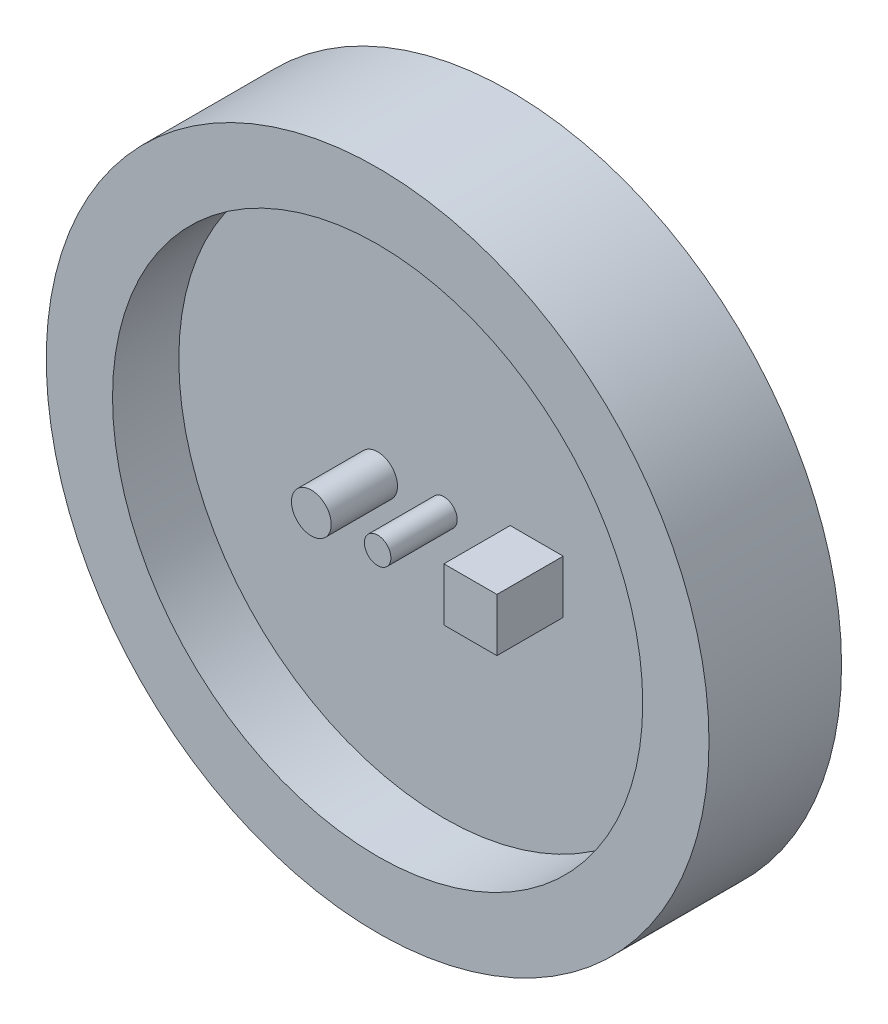
ISO-10303-21;
HEADER;
FILE_DESCRIPTION(('STEP AP214'),'2;1');
FILE_NAME('part.step','',(''),(''),'','','');
FILE_SCHEMA(('AUTOMOTIVE_DESIGN { 1 0 10303 214 1 1 1 1 }'));
ENDSEC;
DATA;
#1=APPLICATION_CONTEXT('core data for automotive mechanical design processes');
#2=APPLICATION_PROTOCOL_DEFINITION('international standard','automotive_design',2000,#1);
#3=PRODUCT_CONTEXT('',#1,'mechanical');
#4=PRODUCT('Part','Part','',(#3));
#5=PRODUCT_RELATED_PRODUCT_CATEGORY('part','',(#4));
#6=PRODUCT_DEFINITION_FORMATION('','',#4);
#7=PRODUCT_DEFINITION_CONTEXT('part definition',#1,'design');
#8=PRODUCT_DEFINITION('design','',#6,#7);
#9=PRODUCT_DEFINITION_SHAPE('','',#8);
#10=(LENGTH_UNIT() NAMED_UNIT(*) SI_UNIT(.MILLI.,.METRE.));
#11=(NAMED_UNIT(*) PLANE_ANGLE_UNIT() SI_UNIT($,.RADIAN.));
#12=(NAMED_UNIT(*) SI_UNIT($,.STERADIAN.) SOLID_ANGLE_UNIT());
#13=UNCERTAINTY_MEASURE_WITH_UNIT(LENGTH_MEASURE(1.E-05),#10,'distance_accuracy_value','');
#14=(GEOMETRIC_REPRESENTATION_CONTEXT(3) GLOBAL_UNCERTAINTY_ASSIGNED_CONTEXT((#13)) GLOBAL_UNIT_ASSIGNED_CONTEXT((#10,
#11,#12)) REPRESENTATION_CONTEXT('',''));
#15=CARTESIAN_POINT('',(0.,0.,0.));
#16=DIRECTION('',(0.,0.,1.));
#17=DIRECTION('',(1.,0.,0.));
#18=AXIS2_PLACEMENT_3D('',#15,#16,#17);
#19=CARTESIAN_POINT('',(0.,0.,5.));
#20=DIRECTION('',(0.,0.,1.));
#21=DIRECTION('',(1.,0.,0.));
#22=AXIS2_PLACEMENT_3D('',#19,#20,#21);
#23=PLANE('',#22);
#24=CARTESIAN_POINT('',(0.,0.,5.));
#25=DIRECTION('',(0.,0.,1.));
#26=DIRECTION('',(1.,0.,0.));
#27=AXIS2_PLACEMENT_3D('',#24,#25,#26);
#28=CIRCLE('',#27,1.);
#29=CARTESIAN_POINT('',(1.,0.,5.));
#30=VERTEX_POINT('',#29);
#31=EDGE_CURVE('E186',#30,#30,#28,.T.);
#32=ORIENTED_EDGE('',*,*,#31,.F.);
#33=EDGE_LOOP('',(#32));
#34=FACE_BOUND('',#33,.T.);
#35=CARTESIAN_POINT('',(-5.,-0.0610876748622365,5.));
#36=DIRECTION('',(0.,0.,1.));
#37=DIRECTION('',(1.,0.,0.));
#38=AXIS2_PLACEMENT_3D('',#35,#36,#37);
#39=CIRCLE('',#38,1.5);
#40=CARTESIAN_POINT('',(-3.5,-0.0610876748622365,5.));
#41=VERTEX_POINT('',#40);
#42=EDGE_CURVE('E116',#41,#41,#39,.T.);
#43=ORIENTED_EDGE('',*,*,#42,.F.);
#44=EDGE_LOOP('',(#43));
#45=FACE_BOUND('',#44,.T.);
#46=CARTESIAN_POINT('',(0.,0.,5.));
#47=DIRECTION('',(0.,0.,1.));
#48=DIRECTION('',(1.,0.,0.));
#49=AXIS2_PLACEMENT_3D('',#46,#47,#48);
#50=CIRCLE('',#49,20.);
#51=CARTESIAN_POINT('',(20.,0.,5.));
#52=VERTEX_POINT('',#51);
#53=EDGE_CURVE('E120',#52,#52,#50,.T.);
#54=ORIENTED_EDGE('',*,*,#53,.T.);
#55=EDGE_LOOP('',(#54));
#56=FACE_BOUND('',#55,.T.);
#57=DIRECTION('',(1.,0.,0.));
#58=VECTOR('',#57,1.);
#59=CARTESIAN_POINT('',(5.,-2.38119326458463,5.));
#60=LINE('',#59,#58);
#61=CARTESIAN_POINT('',(5.,-2.38119326458463,5.));
#62=VERTEX_POINT('',#61);
#63=CARTESIAN_POINT('',(9.,-2.38119326458463,5.));
#64=VERTEX_POINT('',#63);
#65=EDGE_CURVE('E94',#62,#64,#60,.T.);
#66=ORIENTED_EDGE('',*,*,#65,.F.);
#67=DIRECTION('',(0.,-1.,0.));
#68=VECTOR('',#67,1.);
#69=CARTESIAN_POINT('',(5.,-2.38119326458463,5.));
#70=LINE('',#69,#68);
#71=CARTESIAN_POINT('',(5.,1.61880673541537,5.));
#72=VERTEX_POINT('',#71);
#73=EDGE_CURVE('E105',#72,#62,#70,.T.);
#74=ORIENTED_EDGE('',*,*,#73,.F.);
#75=DIRECTION('',(-1.,0.,0.));
#76=VECTOR('',#75,1.);
#77=CARTESIAN_POINT('',(5.,1.61880673541537,5.));
#78=LINE('',#77,#76);
#79=CARTESIAN_POINT('',(9.,1.61880673541537,5.));
#80=VERTEX_POINT('',#79);
#81=EDGE_CURVE('E75',#80,#72,#78,.T.);
#82=ORIENTED_EDGE('',*,*,#81,.F.);
#83=DIRECTION('',(0.,1.,0.));
#84=VECTOR('',#83,1.);
#85=CARTESIAN_POINT('',(9.,-2.38119326458463,5.));
#86=LINE('',#85,#84);
#87=EDGE_CURVE('E110',#64,#80,#86,.T.);
#88=ORIENTED_EDGE('',*,*,#87,.F.);
#89=EDGE_LOOP('',(#66,#74,#82,#88));
#90=FACE_BOUND('',#89,.T.);
#91=ADVANCED_FACE('F38',(#34,#45,#56,#90),#23,.T.);
#92=CARTESIAN_POINT('',(0.,0.,10.));
#93=DIRECTION('',(0.,0.,-1.));
#94=DIRECTION('',(-1.,0.,0.));
#95=AXIS2_PLACEMENT_3D('',#92,#93,#94);
#96=CYLINDRICAL_SURFACE('',#95,25.);
#97=CARTESIAN_POINT('',(0.,0.,10.));
#98=DIRECTION('',(0.,0.,1.));
#99=DIRECTION('',(1.,0.,0.));
#100=AXIS2_PLACEMENT_3D('',#97,#98,#99);
#101=CIRCLE('',#100,25.);
#102=CARTESIAN_POINT('',(25.,0.,10.));
#103=VERTEX_POINT('',#102);
#104=EDGE_CURVE('E11',#103,#103,#101,.T.);
#105=ORIENTED_EDGE('',*,*,#104,.F.);
#106=EDGE_LOOP('',(#105));
#107=FACE_BOUND('',#106,.T.);
#108=CARTESIAN_POINT('',(0.,0.,0.));
#109=DIRECTION('',(0.,0.,1.));
#110=DIRECTION('',(1.,0.,0.));
#111=AXIS2_PLACEMENT_3D('',#108,#109,#110);
#112=CIRCLE('',#111,25.);
#113=CARTESIAN_POINT('',(25.,0.,0.));
#114=VERTEX_POINT('',#113);
#115=EDGE_CURVE('E42',#114,#114,#112,.T.);
#116=ORIENTED_EDGE('',*,*,#115,.T.);
#117=EDGE_LOOP('',(#116));
#118=FACE_BOUND('',#117,.T.);
#119=ADVANCED_FACE('F40',(#107,#118),#96,.T.);
#120=CARTESIAN_POINT('',(0.,0.,10.));
#121=DIRECTION('',(0.,0.,1.));
#122=DIRECTION('',(1.,0.,0.));
#123=AXIS2_PLACEMENT_3D('',#120,#121,#122);
#124=PLANE('',#123);
#125=CARTESIAN_POINT('',(0.,0.,10.));
#126=DIRECTION('',(0.,0.,1.));
#127=DIRECTION('',(1.,0.,0.));
#128=AXIS2_PLACEMENT_3D('',#125,#126,#127);
#129=CIRCLE('',#128,20.);
#130=CARTESIAN_POINT('',(20.,0.,10.));
#131=VERTEX_POINT('',#130);
#132=EDGE_CURVE('E125',#131,#131,#129,.T.);
#133=ORIENTED_EDGE('',*,*,#132,.F.);
#134=EDGE_LOOP('',(#133));
#135=FACE_BOUND('',#134,.T.);
#136=ORIENTED_EDGE('',*,*,#104,.T.);
#137=EDGE_LOOP('',(#136));
#138=FACE_BOUND('',#137,.T.);
#139=ADVANCED_FACE('F136',(#135,#138),#124,.T.);
#140=CARTESIAN_POINT('',(0.,0.,0.));
#141=DIRECTION('',(0.,0.,1.));
#142=DIRECTION('',(1.,0.,0.));
#143=AXIS2_PLACEMENT_3D('',#140,#141,#142);
#144=PLANE('',#143);
#145=ORIENTED_EDGE('',*,*,#115,.F.);
#146=EDGE_LOOP('',(#145));
#147=FACE_BOUND('',#146,.T.);
#148=ADVANCED_FACE('F133',(#147),#144,.F.);
#149=CARTESIAN_POINT('',(0.,0.,10.));
#150=DIRECTION('',(0.,0.,-1.));
#151=DIRECTION('',(-1.,0.,0.));
#152=AXIS2_PLACEMENT_3D('',#149,#150,#151);
#153=CYLINDRICAL_SURFACE('',#152,20.);
#154=ORIENTED_EDGE('',*,*,#132,.T.);
#155=EDGE_LOOP('',(#154));
#156=FACE_BOUND('',#155,.T.);
#157=ORIENTED_EDGE('',*,*,#53,.F.);
#158=EDGE_LOOP('',(#157));
#159=FACE_BOUND('',#158,.T.);
#160=ADVANCED_FACE('F135',(#156,#159),#153,.F.);
#161=CARTESIAN_POINT('',(-5.,-0.0610876748622365,10.));
#162=DIRECTION('',(0.,0.,-1.));
#163=DIRECTION('',(-1.,0.,0.));
#164=AXIS2_PLACEMENT_3D('',#161,#162,#163);
#165=CYLINDRICAL_SURFACE('',#164,1.5);
#166=CARTESIAN_POINT('',(-5.,-0.0610876748622365,10.));
#167=DIRECTION('',(0.,0.,1.));
#168=DIRECTION('',(1.,0.,0.));
#169=AXIS2_PLACEMENT_3D('',#166,#167,#168);
#170=CIRCLE('',#169,1.5);
#171=CARTESIAN_POINT('',(-3.5,-0.0610876748622365,10.));
#172=VERTEX_POINT('',#171);
#173=EDGE_CURVE('E117',#172,#172,#170,.T.);
#174=ORIENTED_EDGE('',*,*,#173,.F.);
#175=EDGE_LOOP('',(#174));
#176=FACE_BOUND('',#175,.T.);
#177=ORIENTED_EDGE('',*,*,#42,.T.);
#178=EDGE_LOOP('',(#177));
#179=FACE_BOUND('',#178,.T.);
#180=ADVANCED_FACE('F141',(#176,#179),#165,.T.);
#181=CARTESIAN_POINT('',(-5.,-0.0610876748622365,10.));
#182=DIRECTION('',(0.,0.,1.));
#183=DIRECTION('',(1.,0.,0.));
#184=AXIS2_PLACEMENT_3D('',#181,#182,#183);
#185=PLANE('',#184);
#186=ORIENTED_EDGE('',*,*,#173,.T.);
#187=EDGE_LOOP('',(#186));
#188=FACE_BOUND('',#187,.T.);
#189=ADVANCED_FACE('F157',(#188),#185,.T.);
#190=CARTESIAN_POINT('',(5.,-2.38119326458463,10.));
#191=DIRECTION('',(1.,0.,0.));
#192=DIRECTION('',(0.,0.,-1.));
#193=AXIS2_PLACEMENT_3D('',#190,#191,#192);
#194=PLANE('',#193);
#195=ORIENTED_EDGE('',*,*,#73,.T.);
#196=DIRECTION('',(0.,0.,-1.));
#197=VECTOR('',#196,1.);
#198=CARTESIAN_POINT('',(5.,-2.38119326458463,10.));
#199=LINE('',#198,#197);
#200=CARTESIAN_POINT('',(5.,-2.38119326458463,10.));
#201=VERTEX_POINT('',#200);
#202=EDGE_CURVE('E97',#201,#62,#199,.T.);
#203=ORIENTED_EDGE('',*,*,#202,.F.);
#204=DIRECTION('',(0.,-1.,0.));
#205=VECTOR('',#204,1.);
#206=CARTESIAN_POINT('',(5.,-2.38119326458463,10.));
#207=LINE('',#206,#205);
#208=CARTESIAN_POINT('',(5.,1.61880673541537,10.));
#209=VERTEX_POINT('',#208);
#210=EDGE_CURVE('E87',#209,#201,#207,.T.);
#211=ORIENTED_EDGE('',*,*,#210,.F.);
#212=DIRECTION('',(0.,0.,-1.));
#213=VECTOR('',#212,1.);
#214=CARTESIAN_POINT('',(5.,1.61880673541537,10.));
#215=LINE('',#214,#213);
#216=EDGE_CURVE('E101',#209,#72,#215,.T.);
#217=ORIENTED_EDGE('',*,*,#216,.T.);
#218=EDGE_LOOP('',(#195,#203,#211,#217));
#219=FACE_BOUND('',#218,.T.);
#220=ADVANCED_FACE('F161',(#219),#194,.F.);
#221=CARTESIAN_POINT('',(5.,-2.38119326458463,10.));
#222=DIRECTION('',(0.,1.,0.));
#223=DIRECTION('',(0.,0.,1.));
#224=AXIS2_PLACEMENT_3D('',#221,#222,#223);
#225=PLANE('',#224);
#226=ORIENTED_EDGE('',*,*,#65,.T.);
#227=DIRECTION('',(0.,0.,-1.));
#228=VECTOR('',#227,1.);
#229=CARTESIAN_POINT('',(9.,-2.38119326458463,10.));
#230=LINE('',#229,#228);
#231=CARTESIAN_POINT('',(9.,-2.38119326458463,10.));
#232=VERTEX_POINT('',#231);
#233=EDGE_CURVE('E91',#232,#64,#230,.T.);
#234=ORIENTED_EDGE('',*,*,#233,.F.);
#235=DIRECTION('',(1.,0.,0.));
#236=VECTOR('',#235,1.);
#237=CARTESIAN_POINT('',(5.,-2.38119326458463,10.));
#238=LINE('',#237,#236);
#239=EDGE_CURVE('E82',#201,#232,#238,.T.);
#240=ORIENTED_EDGE('',*,*,#239,.F.);
#241=ORIENTED_EDGE('',*,*,#202,.T.);
#242=EDGE_LOOP('',(#226,#234,#240,#241));
#243=FACE_BOUND('',#242,.T.);
#244=ADVANCED_FACE('F92',(#243),#225,.F.);
#245=CARTESIAN_POINT('',(9.,-2.38119326458463,10.));
#246=DIRECTION('',(-1.,0.,0.));
#247=DIRECTION('',(0.,0.,1.));
#248=AXIS2_PLACEMENT_3D('',#245,#246,#247);
#249=PLANE('',#248);
#250=ORIENTED_EDGE('',*,*,#87,.T.);
#251=DIRECTION('',(0.,0.,-1.));
#252=VECTOR('',#251,1.);
#253=CARTESIAN_POINT('',(9.,1.61880673541537,10.));
#254=LINE('',#253,#252);
#255=CARTESIAN_POINT('',(9.,1.61880673541537,10.));
#256=VERTEX_POINT('',#255);
#257=EDGE_CURVE('E53',#256,#80,#254,.T.);
#258=ORIENTED_EDGE('',*,*,#257,.F.);
#259=DIRECTION('',(0.,1.,0.));
#260=VECTOR('',#259,1.);
#261=CARTESIAN_POINT('',(9.,-2.38119326458463,10.));
#262=LINE('',#261,#260);
#263=EDGE_CURVE('E85',#232,#256,#262,.T.);
#264=ORIENTED_EDGE('',*,*,#263,.F.);
#265=ORIENTED_EDGE('',*,*,#233,.T.);
#266=EDGE_LOOP('',(#250,#258,#264,#265));
#267=FACE_BOUND('',#266,.T.);
#268=ADVANCED_FACE('F99',(#267),#249,.F.);
#269=CARTESIAN_POINT('',(5.,1.61880673541537,10.));
#270=DIRECTION('',(0.,-1.,0.));
#271=DIRECTION('',(0.,0.,-1.));
#272=AXIS2_PLACEMENT_3D('',#269,#270,#271);
#273=PLANE('',#272);
#274=ORIENTED_EDGE('',*,*,#81,.T.);
#275=ORIENTED_EDGE('',*,*,#216,.F.);
#276=DIRECTION('',(-1.,0.,0.));
#277=VECTOR('',#276,1.);
#278=CARTESIAN_POINT('',(5.,1.61880673541537,10.));
#279=LINE('',#278,#277);
#280=EDGE_CURVE('E61',#256,#209,#279,.T.);
#281=ORIENTED_EDGE('',*,*,#280,.F.);
#282=ORIENTED_EDGE('',*,*,#257,.T.);
#283=EDGE_LOOP('',(#274,#275,#281,#282));
#284=FACE_BOUND('',#283,.T.);
#285=ADVANCED_FACE('F170',(#284),#273,.F.);
#286=CARTESIAN_POINT('',(0.,0.,10.));
#287=DIRECTION('',(0.,0.,-1.));
#288=DIRECTION('',(-1.,0.,0.));
#289=AXIS2_PLACEMENT_3D('',#286,#287,#288);
#290=PLANE('',#289);
#291=ORIENTED_EDGE('',*,*,#210,.T.);
#292=ORIENTED_EDGE('',*,*,#239,.T.);
#293=ORIENTED_EDGE('',*,*,#263,.T.);
#294=ORIENTED_EDGE('',*,*,#280,.T.);
#295=EDGE_LOOP('',(#291,#292,#293,#294));
#296=FACE_BOUND('',#295,.T.);
#297=ADVANCED_FACE('F83',(#296),#290,.F.);
#298=CARTESIAN_POINT('',(0.,0.,10.));
#299=DIRECTION('',(0.,0.,-1.));
#300=DIRECTION('',(-1.,0.,0.));
#301=AXIS2_PLACEMENT_3D('',#298,#299,#300);
#302=CYLINDRICAL_SURFACE('',#301,1.);
#303=CARTESIAN_POINT('',(0.,0.,10.));
#304=DIRECTION('',(0.,0.,1.));
#305=DIRECTION('',(1.,0.,0.));
#306=AXIS2_PLACEMENT_3D('',#303,#304,#305);
#307=CIRCLE('',#306,1.);
#308=CARTESIAN_POINT('',(1.,0.,10.));
#309=VERTEX_POINT('',#308);
#310=EDGE_CURVE('E108',#309,#309,#307,.T.);
#311=ORIENTED_EDGE('',*,*,#310,.F.);
#312=EDGE_LOOP('',(#311));
#313=FACE_BOUND('',#312,.T.);
#314=ORIENTED_EDGE('',*,*,#31,.T.);
#315=EDGE_LOOP('',(#314));
#316=FACE_BOUND('',#315,.T.);
#317=ADVANCED_FACE('F175',(#313,#316),#302,.T.);
#318=CARTESIAN_POINT('',(0.,0.,10.));
#319=DIRECTION('',(0.,0.,1.));
#320=DIRECTION('',(1.,0.,0.));
#321=AXIS2_PLACEMENT_3D('',#318,#319,#320);
#322=PLANE('',#321);
#323=ORIENTED_EDGE('',*,*,#310,.T.);
#324=EDGE_LOOP('',(#323));
#325=FACE_BOUND('',#324,.T.);
#326=ADVANCED_FACE('F178',(#325),#322,.T.);
#327=CLOSED_SHELL('',(#91,#119,#139,#148,#160,#180,#189,#220,#244,#268,#285,#297,#317,#326));
#328=MANIFOLD_SOLID_BREP('B2',#327);
#329=ADVANCED_BREP_SHAPE_REPRESENTATION('',(#18,#328),#14);
#330=SHAPE_DEFINITION_REPRESENTATION(#9,#329);
ENDSEC;
END-ISO-10303-21;
